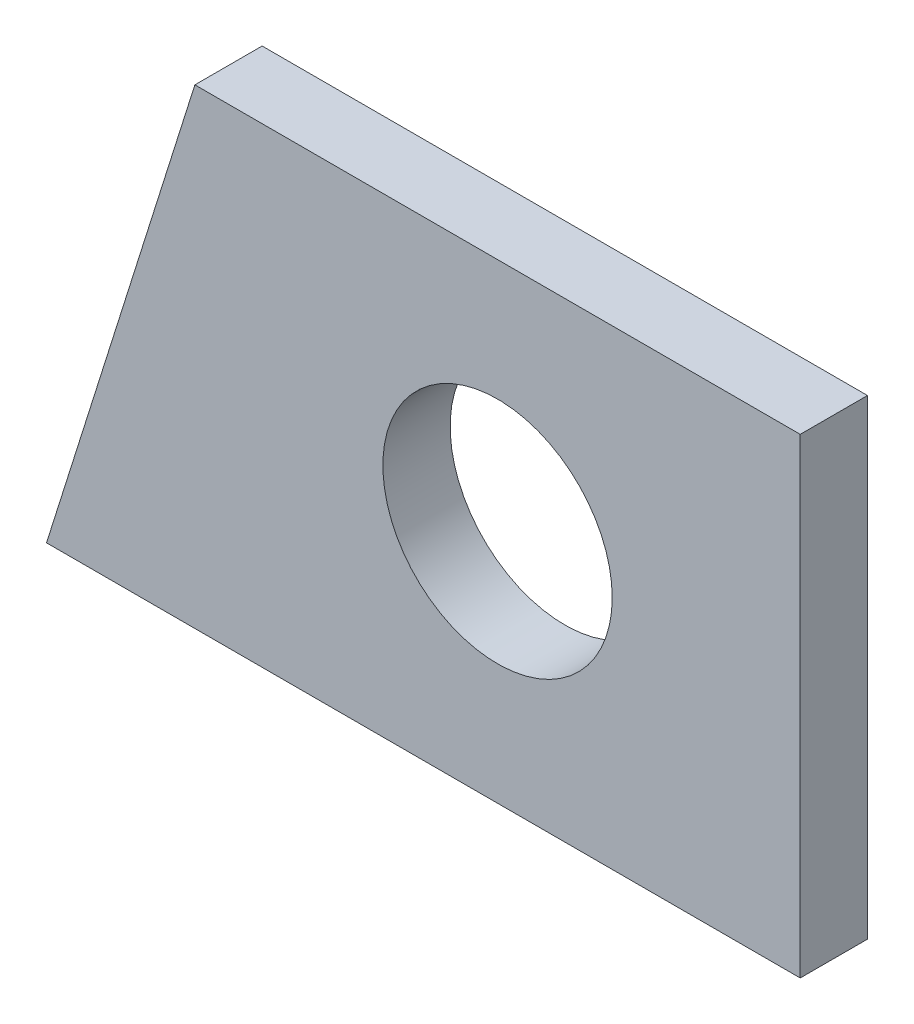
ISO-10303-21;
HEADER;
FILE_DESCRIPTION(('STEP AP214'),'2;1');
FILE_NAME('part.step','',(''),(''),'','','');
FILE_SCHEMA(('AUTOMOTIVE_DESIGN { 1 0 10303 214 1 1 1 1 }'));
ENDSEC;
DATA;
#1=APPLICATION_CONTEXT('core data for automotive mechanical design processes');
#2=APPLICATION_PROTOCOL_DEFINITION('international standard','automotive_design',2000,#1);
#3=PRODUCT_CONTEXT('',#1,'mechanical');
#4=PRODUCT('Part','Part','',(#3));
#5=PRODUCT_RELATED_PRODUCT_CATEGORY('part','',(#4));
#6=PRODUCT_DEFINITION_FORMATION('','',#4);
#7=PRODUCT_DEFINITION_CONTEXT('part definition',#1,'design');
#8=PRODUCT_DEFINITION('design','',#6,#7);
#9=PRODUCT_DEFINITION_SHAPE('','',#8);
#10=(LENGTH_UNIT() NAMED_UNIT(*) SI_UNIT(.MILLI.,.METRE.));
#11=(NAMED_UNIT(*) PLANE_ANGLE_UNIT() SI_UNIT($,.RADIAN.));
#12=(NAMED_UNIT(*) SI_UNIT($,.STERADIAN.) SOLID_ANGLE_UNIT());
#13=UNCERTAINTY_MEASURE_WITH_UNIT(LENGTH_MEASURE(1.E-05),#10,'distance_accuracy_value','');
#14=(GEOMETRIC_REPRESENTATION_CONTEXT(3) GLOBAL_UNCERTAINTY_ASSIGNED_CONTEXT((#13)) GLOBAL_UNIT_ASSIGNED_CONTEXT((#10,
#11,#12)) REPRESENTATION_CONTEXT('',''));
#15=CARTESIAN_POINT('',(0.,0.,0.));
#16=DIRECTION('',(0.,0.,1.));
#17=DIRECTION('',(1.,0.,0.));
#18=AXIS2_PLACEMENT_3D('',#15,#16,#17);
#19=CARTESIAN_POINT('',(0.,0.,1.));
#20=DIRECTION('',(0.,0.,-1.));
#21=DIRECTION('',(-1.,0.,0.));
#22=AXIS2_PLACEMENT_3D('',#19,#20,#21);
#23=PLANE('',#22);
#24=DIRECTION('',(-1.,0.,0.));
#25=VECTOR('',#24,1.);
#26=CARTESIAN_POINT('',(5.60287420464197,3.5,1.));
#27=LINE('',#26,#25);
#28=CARTESIAN_POINT('',(5.60287420464197,3.5,1.));
#29=VERTEX_POINT('',#28);
#30=CARTESIAN_POINT('',(-3.39712579535803,3.5,1.));
#31=VERTEX_POINT('',#30);
#32=EDGE_CURVE('E92',#29,#31,#27,.T.);
#33=ORIENTED_EDGE('',*,*,#32,.T.);
#34=DIRECTION('',(-0.300539339915884,-0.953769419284831,0.));
#35=VECTOR('',#34,1.);
#36=CARTESIAN_POINT('',(-3.39712579535803,3.5,1.));
#37=LINE('',#36,#35);
#38=CARTESIAN_POINT('',(-5.60287420464198,-3.5,1.));
#39=VERTEX_POINT('',#38);
#40=EDGE_CURVE('E87',#31,#39,#37,.T.);
#41=ORIENTED_EDGE('',*,*,#40,.T.);
#42=DIRECTION('',(1.,0.,0.));
#43=VECTOR('',#42,1.);
#44=CARTESIAN_POINT('',(-5.60287420464198,-3.5,1.));
#45=LINE('',#44,#43);
#46=CARTESIAN_POINT('',(5.60287420464197,-3.5,1.));
#47=VERTEX_POINT('',#46);
#48=EDGE_CURVE('E90',#39,#47,#45,.T.);
#49=ORIENTED_EDGE('',*,*,#48,.T.);
#50=DIRECTION('',(0.,1.,0.));
#51=VECTOR('',#50,1.);
#52=CARTESIAN_POINT('',(5.60287420464197,-3.5,1.));
#53=LINE('',#52,#51);
#54=EDGE_CURVE('E57',#47,#29,#53,.T.);
#55=ORIENTED_EDGE('',*,*,#54,.T.);
#56=EDGE_LOOP('',(#33,#41,#49,#55));
#57=FACE_BOUND('',#56,.T.);
#58=CARTESIAN_POINT('',(1.10287420464197,0.,1.));
#59=DIRECTION('',(0.,0.,1.));
#60=DIRECTION('',(1.,0.,0.));
#61=AXIS2_PLACEMENT_3D('',#58,#59,#60);
#62=CIRCLE('',#61,1.705);
#63=CARTESIAN_POINT('',(2.80787420464197,0.,1.));
#64=VERTEX_POINT('',#63);
#65=EDGE_CURVE('E112',#64,#64,#62,.T.);
#66=ORIENTED_EDGE('',*,*,#65,.F.);
#67=EDGE_LOOP('',(#66));
#68=FACE_BOUND('',#67,.T.);
#69=ADVANCED_FACE('F39',(#57,#68),#23,.F.);
#70=CARTESIAN_POINT('',(0.,0.,0.));
#71=DIRECTION('',(0.,0.,-1.));
#72=DIRECTION('',(-1.,0.,0.));
#73=AXIS2_PLACEMENT_3D('',#70,#71,#72);
#74=PLANE('',#73);
#75=DIRECTION('',(-1.,0.,0.));
#76=VECTOR('',#75,1.);
#77=CARTESIAN_POINT('',(5.60287420464197,3.5,0.));
#78=LINE('',#77,#76);
#79=CARTESIAN_POINT('',(5.60287420464197,3.5,0.));
#80=VERTEX_POINT('',#79);
#81=CARTESIAN_POINT('',(-3.39712579535803,3.5,0.));
#82=VERTEX_POINT('',#81);
#83=EDGE_CURVE('E108',#80,#82,#78,.T.);
#84=ORIENTED_EDGE('',*,*,#83,.F.);
#85=DIRECTION('',(0.,1.,0.));
#86=VECTOR('',#85,1.);
#87=CARTESIAN_POINT('',(5.60287420464197,-3.5,0.));
#88=LINE('',#87,#86);
#89=CARTESIAN_POINT('',(5.60287420464197,-3.5,0.));
#90=VERTEX_POINT('',#89);
#91=EDGE_CURVE('E80',#90,#80,#88,.T.);
#92=ORIENTED_EDGE('',*,*,#91,.F.);
#93=DIRECTION('',(1.,0.,0.));
#94=VECTOR('',#93,1.);
#95=CARTESIAN_POINT('',(-5.60287420464198,-3.5,0.));
#96=LINE('',#95,#94);
#97=CARTESIAN_POINT('',(-5.60287420464198,-3.5,0.));
#98=VERTEX_POINT('',#97);
#99=EDGE_CURVE('E74',#98,#90,#96,.T.);
#100=ORIENTED_EDGE('',*,*,#99,.F.);
#101=DIRECTION('',(-0.300539339915884,-0.953769419284831,0.));
#102=VECTOR('',#101,1.);
#103=CARTESIAN_POINT('',(-3.39712579535803,3.5,0.));
#104=LINE('',#103,#102);
#105=EDGE_CURVE('E97',#82,#98,#104,.T.);
#106=ORIENTED_EDGE('',*,*,#105,.F.);
#107=EDGE_LOOP('',(#84,#92,#100,#106));
#108=FACE_BOUND('',#107,.T.);
#109=CARTESIAN_POINT('',(1.10287420464197,0.,0.));
#110=DIRECTION('',(0.,0.,1.));
#111=DIRECTION('',(1.,0.,0.));
#112=AXIS2_PLACEMENT_3D('',#109,#110,#111);
#113=CIRCLE('',#112,1.705);
#114=CARTESIAN_POINT('',(2.80787420464197,0.,0.));
#115=VERTEX_POINT('',#114);
#116=EDGE_CURVE('E130',#115,#115,#113,.T.);
#117=ORIENTED_EDGE('',*,*,#116,.T.);
#118=EDGE_LOOP('',(#117));
#119=FACE_BOUND('',#118,.T.);
#120=ADVANCED_FACE('F125',(#108,#119),#74,.T.);
#121=CARTESIAN_POINT('',(5.60287420464197,3.5,1.));
#122=DIRECTION('',(0.,-1.,0.));
#123=DIRECTION('',(0.,0.,-1.));
#124=AXIS2_PLACEMENT_3D('',#121,#122,#123);
#125=PLANE('',#124);
#126=ORIENTED_EDGE('',*,*,#83,.T.);
#127=DIRECTION('',(0.,0.,-1.));
#128=VECTOR('',#127,1.);
#129=CARTESIAN_POINT('',(-3.39712579535803,3.5,1.));
#130=LINE('',#129,#128);
#131=EDGE_CURVE('E11',#31,#82,#130,.T.);
#132=ORIENTED_EDGE('',*,*,#131,.F.);
#133=ORIENTED_EDGE('',*,*,#32,.F.);
#134=DIRECTION('',(0.,0.,-1.));
#135=VECTOR('',#134,1.);
#136=CARTESIAN_POINT('',(5.60287420464197,3.5,1.));
#137=LINE('',#136,#135);
#138=EDGE_CURVE('E104',#29,#80,#137,.T.);
#139=ORIENTED_EDGE('',*,*,#138,.T.);
#140=EDGE_LOOP('',(#126,#132,#133,#139));
#141=FACE_BOUND('',#140,.T.);
#142=ADVANCED_FACE('F41',(#141),#125,.F.);
#143=CARTESIAN_POINT('',(-3.39712579535803,3.5,1.));
#144=DIRECTION('',(0.953769419284831,-0.300539339915884,0.));
#145=DIRECTION('',(0.300539339915884,0.953769419284831,0.));
#146=AXIS2_PLACEMENT_3D('',#143,#144,#145);
#147=PLANE('',#146);
#148=ORIENTED_EDGE('',*,*,#105,.T.);
#149=DIRECTION('',(0.,0.,-1.));
#150=VECTOR('',#149,1.);
#151=CARTESIAN_POINT('',(-5.60287420464198,-3.5,1.));
#152=LINE('',#151,#150);
#153=EDGE_CURVE('E49',#39,#98,#152,.T.);
#154=ORIENTED_EDGE('',*,*,#153,.F.);
#155=ORIENTED_EDGE('',*,*,#40,.F.);
#156=ORIENTED_EDGE('',*,*,#131,.T.);
#157=EDGE_LOOP('',(#148,#154,#155,#156));
#158=FACE_BOUND('',#157,.T.);
#159=ADVANCED_FACE('F96',(#158),#147,.F.);
#160=CARTESIAN_POINT('',(-5.60287420464198,-3.5,1.));
#161=DIRECTION('',(0.,1.,0.));
#162=DIRECTION('',(-1.,0.,0.));
#163=AXIS2_PLACEMENT_3D('',#160,#161,#162);
#164=PLANE('',#163);
#165=ORIENTED_EDGE('',*,*,#99,.T.);
#166=DIRECTION('',(0.,0.,-1.));
#167=VECTOR('',#166,1.);
#168=CARTESIAN_POINT('',(5.60287420464197,-3.5,1.));
#169=LINE('',#168,#167);
#170=EDGE_CURVE('E99',#47,#90,#169,.T.);
#171=ORIENTED_EDGE('',*,*,#170,.F.);
#172=ORIENTED_EDGE('',*,*,#48,.F.);
#173=ORIENTED_EDGE('',*,*,#153,.T.);
#174=EDGE_LOOP('',(#165,#171,#172,#173));
#175=FACE_BOUND('',#174,.T.);
#176=ADVANCED_FACE('F100',(#175),#164,.F.);
#177=CARTESIAN_POINT('',(5.60287420464197,-3.5,1.));
#178=DIRECTION('',(-1.,0.,0.));
#179=DIRECTION('',(0.,0.,1.));
#180=AXIS2_PLACEMENT_3D('',#177,#178,#179);
#181=PLANE('',#180);
#182=ORIENTED_EDGE('',*,*,#91,.T.);
#183=ORIENTED_EDGE('',*,*,#138,.F.);
#184=ORIENTED_EDGE('',*,*,#54,.F.);
#185=ORIENTED_EDGE('',*,*,#170,.T.);
#186=EDGE_LOOP('',(#182,#183,#184,#185));
#187=FACE_BOUND('',#186,.T.);
#188=ADVANCED_FACE('F122',(#187),#181,.F.);
#189=CARTESIAN_POINT('',(1.10287420464197,0.,1.));
#190=DIRECTION('',(0.,0.,-1.));
#191=DIRECTION('',(-1.,0.,0.));
#192=AXIS2_PLACEMENT_3D('',#189,#190,#191);
#193=CYLINDRICAL_SURFACE('',#192,1.705);
#194=ORIENTED_EDGE('',*,*,#65,.T.);
#195=EDGE_LOOP('',(#194));
#196=FACE_BOUND('',#195,.T.);
#197=ORIENTED_EDGE('',*,*,#116,.F.);
#198=EDGE_LOOP('',(#197));
#199=FACE_BOUND('',#198,.T.);
#200=ADVANCED_FACE('F138',(#196,#199),#193,.F.);
#201=CLOSED_SHELL('',(#69,#120,#142,#159,#176,#188,#200));
#202=MANIFOLD_SOLID_BREP('B2',#201);
#203=ADVANCED_BREP_SHAPE_REPRESENTATION('',(#18,#202),#14);
#204=SHAPE_DEFINITION_REPRESENTATION(#9,#203);
ENDSEC;
END-ISO-10303-21;
